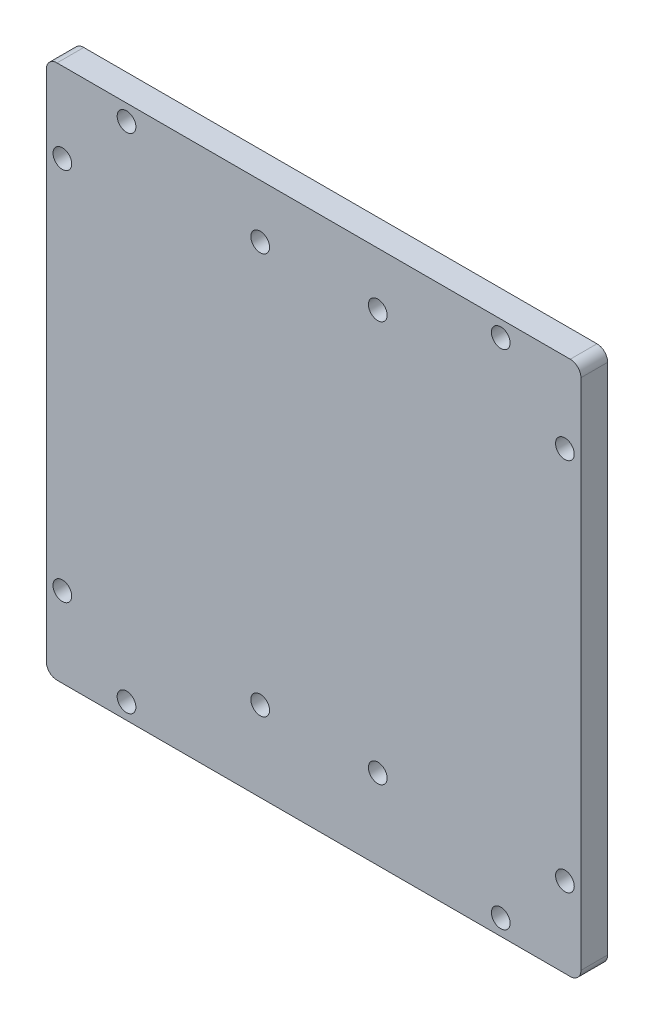
ISO-10303-21;
HEADER;
FILE_DESCRIPTION(('STEP AP214'),'2;1');
FILE_NAME('part.step','',(''),(''),'','','');
FILE_SCHEMA(('AUTOMOTIVE_DESIGN { 1 0 10303 214 1 1 1 1 }'));
ENDSEC;
DATA;
#1=APPLICATION_CONTEXT('core data for automotive mechanical design processes');
#2=APPLICATION_PROTOCOL_DEFINITION('international standard','automotive_design',2000,#1);
#3=PRODUCT_CONTEXT('',#1,'mechanical');
#4=PRODUCT('Part','Part','',(#3));
#5=PRODUCT_RELATED_PRODUCT_CATEGORY('part','',(#4));
#6=PRODUCT_DEFINITION_FORMATION('','',#4);
#7=PRODUCT_DEFINITION_CONTEXT('part definition',#1,'design');
#8=PRODUCT_DEFINITION('design','',#6,#7);
#9=PRODUCT_DEFINITION_SHAPE('','',#8);
#10=(LENGTH_UNIT() NAMED_UNIT(*) SI_UNIT(.MILLI.,.METRE.));
#11=(NAMED_UNIT(*) PLANE_ANGLE_UNIT() SI_UNIT($,.RADIAN.));
#12=(NAMED_UNIT(*) SI_UNIT($,.STERADIAN.) SOLID_ANGLE_UNIT());
#13=UNCERTAINTY_MEASURE_WITH_UNIT(LENGTH_MEASURE(1.E-05),#10,'distance_accuracy_value','');
#14=(GEOMETRIC_REPRESENTATION_CONTEXT(3) GLOBAL_UNCERTAINTY_ASSIGNED_CONTEXT((#13)) GLOBAL_UNIT_ASSIGNED_CONTEXT((#10,
#11,#12)) REPRESENTATION_CONTEXT('',''));
#15=CARTESIAN_POINT('',(0.,0.,0.));
#16=DIRECTION('',(0.,0.,1.));
#17=DIRECTION('',(1.,0.,0.));
#18=AXIS2_PLACEMENT_3D('',#15,#16,#17);
#19=CARTESIAN_POINT('',(-48.,-48.,5.));
#20=DIRECTION('',(0.,0.,1.));
#21=DIRECTION('',(1.,0.,0.));
#22=AXIS2_PLACEMENT_3D('',#19,#20,#21);
#23=PLANE('',#22);
#24=CARTESIAN_POINT('',(-9.99999999999998,-35.,5.));
#25=DIRECTION('',(0.,0.,1.));
#26=DIRECTION('',(1.,0.,0.));
#27=AXIS2_PLACEMENT_3D('',#24,#25,#26);
#28=CIRCLE('',#27,1.75);
#29=CARTESIAN_POINT('',(-8.24999999999998,-35.,5.));
#30=VERTEX_POINT('',#29);
#31=EDGE_CURVE('E236',#30,#30,#28,.T.);
#32=ORIENTED_EDGE('',*,*,#31,.F.);
#33=EDGE_LOOP('',(#32));
#34=FACE_BOUND('',#33,.T.);
#35=CARTESIAN_POINT('',(-35.,-47.,5.));
#36=DIRECTION('',(0.,0.,1.));
#37=DIRECTION('',(-1.,0.,0.));
#38=AXIS2_PLACEMENT_3D('',#35,#36,#37);
#39=CIRCLE('',#38,1.75);
#40=CARTESIAN_POINT('',(-36.75,-47.,5.));
#41=VERTEX_POINT('',#40);
#42=EDGE_CURVE('E224',#41,#41,#39,.T.);
#43=ORIENTED_EDGE('',*,*,#42,.F.);
#44=EDGE_LOOP('',(#43));
#45=FACE_BOUND('',#44,.T.);
#46=CARTESIAN_POINT('',(-35.,47.,5.));
#47=DIRECTION('',(0.,0.,1.));
#48=DIRECTION('',(1.,0.,0.));
#49=AXIS2_PLACEMENT_3D('',#46,#47,#48);
#50=CIRCLE('',#49,1.75);
#51=CARTESIAN_POINT('',(-33.25,47.,5.));
#52=VERTEX_POINT('',#51);
#53=EDGE_CURVE('E212',#52,#52,#50,.T.);
#54=ORIENTED_EDGE('',*,*,#53,.F.);
#55=EDGE_LOOP('',(#54));
#56=FACE_BOUND('',#55,.T.);
#57=CARTESIAN_POINT('',(47.,-35.,5.));
#58=DIRECTION('',(0.,0.,1.));
#59=DIRECTION('',(1.,0.,0.));
#60=AXIS2_PLACEMENT_3D('',#57,#58,#59);
#61=CIRCLE('',#60,1.75);
#62=CARTESIAN_POINT('',(48.75,-35.,5.));
#63=VERTEX_POINT('',#62);
#64=EDGE_CURVE('E200',#63,#63,#61,.T.);
#65=ORIENTED_EDGE('',*,*,#64,.F.);
#66=EDGE_LOOP('',(#65));
#67=FACE_BOUND('',#66,.T.);
#68=CARTESIAN_POINT('',(-47.,35.,5.));
#69=DIRECTION('',(0.,0.,1.));
#70=DIRECTION('',(1.,0.,0.));
#71=AXIS2_PLACEMENT_3D('',#68,#69,#70);
#72=CIRCLE('',#71,1.75);
#73=CARTESIAN_POINT('',(-45.25,35.,5.));
#74=VERTEX_POINT('',#73);
#75=EDGE_CURVE('E188',#74,#74,#72,.T.);
#76=ORIENTED_EDGE('',*,*,#75,.F.);
#77=EDGE_LOOP('',(#76));
#78=FACE_BOUND('',#77,.T.);
#79=CARTESIAN_POINT('',(-10.,40.,5.));
#80=DIRECTION('',(0.,0.,1.));
#81=DIRECTION('',(1.,0.,0.));
#82=AXIS2_PLACEMENT_3D('',#79,#80,#81);
#83=CIRCLE('',#82,1.75);
#84=CARTESIAN_POINT('',(-8.25000000000001,40.,5.));
#85=VERTEX_POINT('',#84);
#86=EDGE_CURVE('E134',#85,#85,#83,.T.);
#87=ORIENTED_EDGE('',*,*,#86,.F.);
#88=EDGE_LOOP('',(#87));
#89=FACE_BOUND('',#88,.T.);
#90=CARTESIAN_POINT('',(-48.,-48.,5.));
#91=DIRECTION('',(0.,0.,1.));
#92=DIRECTION('',(1.,0.,0.));
#93=AXIS2_PLACEMENT_3D('',#90,#91,#92);
#94=CIRCLE('',#93,2.);
#95=CARTESIAN_POINT('',(-50.,-48.,5.));
#96=VERTEX_POINT('',#95);
#97=CARTESIAN_POINT('',(-48.,-50.,5.));
#98=VERTEX_POINT('',#97);
#99=EDGE_CURVE('E145',#96,#98,#94,.T.);
#100=ORIENTED_EDGE('',*,*,#99,.T.);
#101=DIRECTION('',(1.,0.,0.));
#102=VECTOR('',#101,1.);
#103=CARTESIAN_POINT('',(-48.,-50.,5.));
#104=LINE('',#103,#102);
#105=CARTESIAN_POINT('',(48.,-50.,5.));
#106=VERTEX_POINT('',#105);
#107=EDGE_CURVE('E93',#98,#106,#104,.T.);
#108=ORIENTED_EDGE('',*,*,#107,.T.);
#109=CARTESIAN_POINT('',(48.,-48.,5.));
#110=DIRECTION('',(0.,0.,1.));
#111=DIRECTION('',(1.,0.,0.));
#112=AXIS2_PLACEMENT_3D('',#109,#110,#111);
#113=CIRCLE('',#112,2.);
#114=CARTESIAN_POINT('',(50.,-48.,5.));
#115=VERTEX_POINT('',#114);
#116=EDGE_CURVE('E160',#106,#115,#113,.T.);
#117=ORIENTED_EDGE('',*,*,#116,.T.);
#118=DIRECTION('',(0.,1.,0.));
#119=VECTOR('',#118,1.);
#120=CARTESIAN_POINT('',(50.,-48.,5.));
#121=LINE('',#120,#119);
#122=CARTESIAN_POINT('',(50.,48.,5.));
#123=VERTEX_POINT('',#122);
#124=EDGE_CURVE('E173',#115,#123,#121,.T.);
#125=ORIENTED_EDGE('',*,*,#124,.T.);
#126=CARTESIAN_POINT('',(48.,48.,5.));
#127=DIRECTION('',(0.,0.,1.));
#128=DIRECTION('',(1.,0.,0.));
#129=AXIS2_PLACEMENT_3D('',#126,#127,#128);
#130=CIRCLE('',#129,2.);
#131=CARTESIAN_POINT('',(48.,50.,5.));
#132=VERTEX_POINT('',#131);
#133=EDGE_CURVE('E112',#123,#132,#130,.T.);
#134=ORIENTED_EDGE('',*,*,#133,.T.);
#135=DIRECTION('',(-1.,0.,0.));
#136=VECTOR('',#135,1.);
#137=CARTESIAN_POINT('',(-48.,50.,5.));
#138=LINE('',#137,#136);
#139=CARTESIAN_POINT('',(-48.,50.,5.));
#140=VERTEX_POINT('',#139);
#141=EDGE_CURVE('E106',#132,#140,#138,.T.);
#142=ORIENTED_EDGE('',*,*,#141,.T.);
#143=CARTESIAN_POINT('',(-48.,48.,5.));
#144=DIRECTION('',(0.,0.,1.));
#145=DIRECTION('',(1.,0.,0.));
#146=AXIS2_PLACEMENT_3D('',#143,#144,#145);
#147=CIRCLE('',#146,2.);
#148=CARTESIAN_POINT('',(-50.,48.,5.));
#149=VERTEX_POINT('',#148);
#150=EDGE_CURVE('E110',#140,#149,#147,.T.);
#151=ORIENTED_EDGE('',*,*,#150,.T.);
#152=DIRECTION('',(0.,-1.,0.));
#153=VECTOR('',#152,1.);
#154=CARTESIAN_POINT('',(-50.,-48.,5.));
#155=LINE('',#154,#153);
#156=EDGE_CURVE('E50',#149,#96,#155,.T.);
#157=ORIENTED_EDGE('',*,*,#156,.T.);
#158=EDGE_LOOP('',(#100,#108,#117,#125,#134,#142,#151,#157));
#159=FACE_BOUND('',#158,.T.);
#160=CARTESIAN_POINT('',(12.,40.,5.));
#161=DIRECTION('',(0.,0.,1.));
#162=DIRECTION('',(1.,0.,0.));
#163=AXIS2_PLACEMENT_3D('',#160,#161,#162);
#164=CIRCLE('',#163,1.75);
#165=CARTESIAN_POINT('',(13.75,40.,5.));
#166=VERTEX_POINT('',#165);
#167=EDGE_CURVE('E182',#166,#166,#164,.T.);
#168=ORIENTED_EDGE('',*,*,#167,.F.);
#169=EDGE_LOOP('',(#168));
#170=FACE_BOUND('',#169,.T.);
#171=CARTESIAN_POINT('',(47.,35.,5.));
#172=DIRECTION('',(0.,0.,1.));
#173=DIRECTION('',(-1.,0.,0.));
#174=AXIS2_PLACEMENT_3D('',#171,#172,#173);
#175=CIRCLE('',#174,1.75);
#176=CARTESIAN_POINT('',(45.25,35.,5.));
#177=VERTEX_POINT('',#176);
#178=EDGE_CURVE('E194',#177,#177,#175,.T.);
#179=ORIENTED_EDGE('',*,*,#178,.F.);
#180=EDGE_LOOP('',(#179));
#181=FACE_BOUND('',#180,.T.);
#182=CARTESIAN_POINT('',(-47.,-35.,5.));
#183=DIRECTION('',(0.,0.,1.));
#184=DIRECTION('',(-1.,0.,0.));
#185=AXIS2_PLACEMENT_3D('',#182,#183,#184);
#186=CIRCLE('',#185,1.75);
#187=CARTESIAN_POINT('',(-48.75,-35.,5.));
#188=VERTEX_POINT('',#187);
#189=EDGE_CURVE('E206',#188,#188,#186,.T.);
#190=ORIENTED_EDGE('',*,*,#189,.F.);
#191=EDGE_LOOP('',(#190));
#192=FACE_BOUND('',#191,.T.);
#193=CARTESIAN_POINT('',(35.,47.,5.));
#194=DIRECTION('',(0.,0.,1.));
#195=DIRECTION('',(-1.,0.,0.));
#196=AXIS2_PLACEMENT_3D('',#193,#194,#195);
#197=CIRCLE('',#196,1.75);
#198=CARTESIAN_POINT('',(33.25,47.,5.));
#199=VERTEX_POINT('',#198);
#200=EDGE_CURVE('E218',#199,#199,#197,.T.);
#201=ORIENTED_EDGE('',*,*,#200,.F.);
#202=EDGE_LOOP('',(#201));
#203=FACE_BOUND('',#202,.T.);
#204=CARTESIAN_POINT('',(35.,-47.,5.));
#205=DIRECTION('',(0.,0.,1.));
#206=DIRECTION('',(1.,0.,0.));
#207=AXIS2_PLACEMENT_3D('',#204,#205,#206);
#208=CIRCLE('',#207,1.75);
#209=CARTESIAN_POINT('',(36.75,-47.,5.));
#210=VERTEX_POINT('',#209);
#211=EDGE_CURVE('E230',#210,#210,#208,.T.);
#212=ORIENTED_EDGE('',*,*,#211,.F.);
#213=EDGE_LOOP('',(#212));
#214=FACE_BOUND('',#213,.T.);
#215=CARTESIAN_POINT('',(12.,-35.,5.));
#216=DIRECTION('',(0.,0.,1.));
#217=DIRECTION('',(1.,0.,0.));
#218=AXIS2_PLACEMENT_3D('',#215,#216,#217);
#219=CIRCLE('',#218,1.75);
#220=CARTESIAN_POINT('',(13.75,-35.,5.));
#221=VERTEX_POINT('',#220);
#222=EDGE_CURVE('E242',#221,#221,#219,.T.);
#223=ORIENTED_EDGE('',*,*,#222,.F.);
#224=EDGE_LOOP('',(#223));
#225=FACE_BOUND('',#224,.T.);
#226=ADVANCED_FACE('F33',(#34,#45,#56,#67,#78,#89,#159,#170,#181,#192,#203,#214,#225),#23,.T.);
#227=CARTESIAN_POINT('',(-48.,-48.,0.));
#228=DIRECTION('',(0.,0.,1.));
#229=DIRECTION('',(1.,0.,0.));
#230=AXIS2_PLACEMENT_3D('',#227,#228,#229);
#231=PLANE('',#230);
#232=CARTESIAN_POINT('',(-48.,-48.,0.));
#233=DIRECTION('',(0.,0.,1.));
#234=DIRECTION('',(1.,0.,0.));
#235=AXIS2_PLACEMENT_3D('',#232,#233,#234);
#236=CIRCLE('',#235,2.);
#237=CARTESIAN_POINT('',(-50.,-48.,0.));
#238=VERTEX_POINT('',#237);
#239=CARTESIAN_POINT('',(-48.,-50.,0.));
#240=VERTEX_POINT('',#239);
#241=EDGE_CURVE('E130',#238,#240,#236,.T.);
#242=ORIENTED_EDGE('',*,*,#241,.F.);
#243=DIRECTION('',(0.,-1.,0.));
#244=VECTOR('',#243,1.);
#245=CARTESIAN_POINT('',(-50.,-48.,0.));
#246=LINE('',#245,#244);
#247=CARTESIAN_POINT('',(-50.,48.,0.));
#248=VERTEX_POINT('',#247);
#249=EDGE_CURVE('E85',#248,#238,#246,.T.);
#250=ORIENTED_EDGE('',*,*,#249,.F.);
#251=CARTESIAN_POINT('',(-48.,48.,0.));
#252=DIRECTION('',(0.,0.,1.));
#253=DIRECTION('',(1.,0.,0.));
#254=AXIS2_PLACEMENT_3D('',#251,#252,#253);
#255=CIRCLE('',#254,2.);
#256=CARTESIAN_POINT('',(-48.,50.,0.));
#257=VERTEX_POINT('',#256);
#258=EDGE_CURVE('E79',#257,#248,#255,.T.);
#259=ORIENTED_EDGE('',*,*,#258,.F.);
#260=DIRECTION('',(-1.,0.,0.));
#261=VECTOR('',#260,1.);
#262=CARTESIAN_POINT('',(-48.,50.,0.));
#263=LINE('',#262,#261);
#264=CARTESIAN_POINT('',(48.,50.,0.));
#265=VERTEX_POINT('',#264);
#266=EDGE_CURVE('E120',#265,#257,#263,.T.);
#267=ORIENTED_EDGE('',*,*,#266,.F.);
#268=CARTESIAN_POINT('',(48.,48.,0.));
#269=DIRECTION('',(0.,0.,1.));
#270=DIRECTION('',(1.,0.,0.));
#271=AXIS2_PLACEMENT_3D('',#268,#269,#270);
#272=CIRCLE('',#271,2.);
#273=CARTESIAN_POINT('',(50.,48.,0.));
#274=VERTEX_POINT('',#273);
#275=EDGE_CURVE('E140',#274,#265,#272,.T.);
#276=ORIENTED_EDGE('',*,*,#275,.F.);
#277=DIRECTION('',(0.,1.,0.));
#278=VECTOR('',#277,1.);
#279=CARTESIAN_POINT('',(50.,-48.,0.));
#280=LINE('',#279,#278);
#281=CARTESIAN_POINT('',(50.,-48.,0.));
#282=VERTEX_POINT('',#281);
#283=EDGE_CURVE('E138',#282,#274,#280,.T.);
#284=ORIENTED_EDGE('',*,*,#283,.F.);
#285=CARTESIAN_POINT('',(48.,-48.,0.));
#286=DIRECTION('',(0.,0.,1.));
#287=DIRECTION('',(1.,0.,0.));
#288=AXIS2_PLACEMENT_3D('',#285,#286,#287);
#289=CIRCLE('',#288,2.);
#290=CARTESIAN_POINT('',(48.,-50.,0.));
#291=VERTEX_POINT('',#290);
#292=EDGE_CURVE('E136',#291,#282,#289,.T.);
#293=ORIENTED_EDGE('',*,*,#292,.F.);
#294=DIRECTION('',(1.,0.,0.));
#295=VECTOR('',#294,1.);
#296=CARTESIAN_POINT('',(-48.,-50.,0.));
#297=LINE('',#296,#295);
#298=EDGE_CURVE('E133',#240,#291,#297,.T.);
#299=ORIENTED_EDGE('',*,*,#298,.F.);
#300=EDGE_LOOP('',(#242,#250,#259,#267,#276,#284,#293,#299));
#301=FACE_BOUND('',#300,.T.);
#302=CARTESIAN_POINT('',(-10.,40.,0.));
#303=DIRECTION('',(0.,0.,1.));
#304=DIRECTION('',(1.,0.,0.));
#305=AXIS2_PLACEMENT_3D('',#302,#303,#304);
#306=CIRCLE('',#305,1.75);
#307=CARTESIAN_POINT('',(-8.25000000000001,40.,0.));
#308=VERTEX_POINT('',#307);
#309=EDGE_CURVE('E179',#308,#308,#306,.T.);
#310=ORIENTED_EDGE('',*,*,#309,.T.);
#311=EDGE_LOOP('',(#310));
#312=FACE_BOUND('',#311,.T.);
#313=CARTESIAN_POINT('',(12.,40.,0.));
#314=DIRECTION('',(0.,0.,1.));
#315=DIRECTION('',(1.,0.,0.));
#316=AXIS2_PLACEMENT_3D('',#313,#314,#315);
#317=CIRCLE('',#316,1.75);
#318=CARTESIAN_POINT('',(13.75,40.,0.));
#319=VERTEX_POINT('',#318);
#320=EDGE_CURVE('E185',#319,#319,#317,.T.);
#321=ORIENTED_EDGE('',*,*,#320,.T.);
#322=EDGE_LOOP('',(#321));
#323=FACE_BOUND('',#322,.T.);
#324=CARTESIAN_POINT('',(-47.,35.,0.));
#325=DIRECTION('',(0.,0.,1.));
#326=DIRECTION('',(1.,0.,0.));
#327=AXIS2_PLACEMENT_3D('',#324,#325,#326);
#328=CIRCLE('',#327,1.75);
#329=CARTESIAN_POINT('',(-45.25,35.,0.));
#330=VERTEX_POINT('',#329);
#331=EDGE_CURVE('E191',#330,#330,#328,.T.);
#332=ORIENTED_EDGE('',*,*,#331,.T.);
#333=EDGE_LOOP('',(#332));
#334=FACE_BOUND('',#333,.T.);
#335=CARTESIAN_POINT('',(47.,35.,0.));
#336=DIRECTION('',(0.,0.,1.));
#337=DIRECTION('',(-1.,0.,0.));
#338=AXIS2_PLACEMENT_3D('',#335,#336,#337);
#339=CIRCLE('',#338,1.75);
#340=CARTESIAN_POINT('',(45.25,35.,0.));
#341=VERTEX_POINT('',#340);
#342=EDGE_CURVE('E197',#341,#341,#339,.T.);
#343=ORIENTED_EDGE('',*,*,#342,.T.);
#344=EDGE_LOOP('',(#343));
#345=FACE_BOUND('',#344,.T.);
#346=CARTESIAN_POINT('',(47.,-35.,0.));
#347=DIRECTION('',(0.,0.,1.));
#348=DIRECTION('',(1.,0.,0.));
#349=AXIS2_PLACEMENT_3D('',#346,#347,#348);
#350=CIRCLE('',#349,1.75);
#351=CARTESIAN_POINT('',(48.75,-35.,0.));
#352=VERTEX_POINT('',#351);
#353=EDGE_CURVE('E203',#352,#352,#350,.T.);
#354=ORIENTED_EDGE('',*,*,#353,.T.);
#355=EDGE_LOOP('',(#354));
#356=FACE_BOUND('',#355,.T.);
#357=CARTESIAN_POINT('',(-47.,-35.,0.));
#358=DIRECTION('',(0.,0.,1.));
#359=DIRECTION('',(-1.,0.,0.));
#360=AXIS2_PLACEMENT_3D('',#357,#358,#359);
#361=CIRCLE('',#360,1.75);
#362=CARTESIAN_POINT('',(-48.75,-35.,0.));
#363=VERTEX_POINT('',#362);
#364=EDGE_CURVE('E209',#363,#363,#361,.T.);
#365=ORIENTED_EDGE('',*,*,#364,.T.);
#366=EDGE_LOOP('',(#365));
#367=FACE_BOUND('',#366,.T.);
#368=CARTESIAN_POINT('',(-35.,47.,0.));
#369=DIRECTION('',(0.,0.,1.));
#370=DIRECTION('',(1.,0.,0.));
#371=AXIS2_PLACEMENT_3D('',#368,#369,#370);
#372=CIRCLE('',#371,1.75);
#373=CARTESIAN_POINT('',(-33.25,47.,0.));
#374=VERTEX_POINT('',#373);
#375=EDGE_CURVE('E215',#374,#374,#372,.T.);
#376=ORIENTED_EDGE('',*,*,#375,.T.);
#377=EDGE_LOOP('',(#376));
#378=FACE_BOUND('',#377,.T.);
#379=CARTESIAN_POINT('',(35.,47.,0.));
#380=DIRECTION('',(0.,0.,1.));
#381=DIRECTION('',(-1.,0.,0.));
#382=AXIS2_PLACEMENT_3D('',#379,#380,#381);
#383=CIRCLE('',#382,1.75);
#384=CARTESIAN_POINT('',(33.25,47.,0.));
#385=VERTEX_POINT('',#384);
#386=EDGE_CURVE('E221',#385,#385,#383,.T.);
#387=ORIENTED_EDGE('',*,*,#386,.T.);
#388=EDGE_LOOP('',(#387));
#389=FACE_BOUND('',#388,.T.);
#390=CARTESIAN_POINT('',(-35.,-47.,0.));
#391=DIRECTION('',(0.,0.,1.));
#392=DIRECTION('',(-1.,0.,0.));
#393=AXIS2_PLACEMENT_3D('',#390,#391,#392);
#394=CIRCLE('',#393,1.75);
#395=CARTESIAN_POINT('',(-36.75,-47.,0.));
#396=VERTEX_POINT('',#395);
#397=EDGE_CURVE('E227',#396,#396,#394,.T.);
#398=ORIENTED_EDGE('',*,*,#397,.T.);
#399=EDGE_LOOP('',(#398));
#400=FACE_BOUND('',#399,.T.);
#401=CARTESIAN_POINT('',(35.,-47.,0.));
#402=DIRECTION('',(0.,0.,1.));
#403=DIRECTION('',(1.,0.,0.));
#404=AXIS2_PLACEMENT_3D('',#401,#402,#403);
#405=CIRCLE('',#404,1.75);
#406=CARTESIAN_POINT('',(36.75,-47.,0.));
#407=VERTEX_POINT('',#406);
#408=EDGE_CURVE('E233',#407,#407,#405,.T.);
#409=ORIENTED_EDGE('',*,*,#408,.T.);
#410=EDGE_LOOP('',(#409));
#411=FACE_BOUND('',#410,.T.);
#412=CARTESIAN_POINT('',(-9.99999999999998,-35.,0.));
#413=DIRECTION('',(0.,0.,1.));
#414=DIRECTION('',(1.,0.,0.));
#415=AXIS2_PLACEMENT_3D('',#412,#413,#414);
#416=CIRCLE('',#415,1.75);
#417=CARTESIAN_POINT('',(-8.24999999999998,-35.,0.));
#418=VERTEX_POINT('',#417);
#419=EDGE_CURVE('E239',#418,#418,#416,.T.);
#420=ORIENTED_EDGE('',*,*,#419,.T.);
#421=EDGE_LOOP('',(#420));
#422=FACE_BOUND('',#421,.T.);
#423=CARTESIAN_POINT('',(12.,-35.,0.));
#424=DIRECTION('',(0.,0.,1.));
#425=DIRECTION('',(1.,0.,0.));
#426=AXIS2_PLACEMENT_3D('',#423,#424,#425);
#427=CIRCLE('',#426,1.75);
#428=CARTESIAN_POINT('',(13.75,-35.,0.));
#429=VERTEX_POINT('',#428);
#430=EDGE_CURVE('E245',#429,#429,#427,.T.);
#431=ORIENTED_EDGE('',*,*,#430,.T.);
#432=EDGE_LOOP('',(#431));
#433=FACE_BOUND('',#432,.T.);
#434=ADVANCED_FACE('F164',(#301,#312,#323,#334,#345,#356,#367,#378,#389,#400,#411,#422,#433),
#231,.F.);
#435=CARTESIAN_POINT('',(-48.,-48.,5.));
#436=DIRECTION('',(0.,0.,-1.));
#437=DIRECTION('',(-1.,0.,0.));
#438=AXIS2_PLACEMENT_3D('',#435,#436,#437);
#439=CYLINDRICAL_SURFACE('',#438,2.);
#440=ORIENTED_EDGE('',*,*,#241,.T.);
#441=DIRECTION('',(0.,0.,-1.));
#442=VECTOR('',#441,1.);
#443=CARTESIAN_POINT('',(-48.,-50.,5.));
#444=LINE('',#443,#442);
#445=EDGE_CURVE('E11',#98,#240,#444,.T.);
#446=ORIENTED_EDGE('',*,*,#445,.F.);
#447=ORIENTED_EDGE('',*,*,#99,.F.);
#448=DIRECTION('',(0.,0.,-1.));
#449=VECTOR('',#448,1.);
#450=CARTESIAN_POINT('',(-50.,-48.,5.));
#451=LINE('',#450,#449);
#452=EDGE_CURVE('E126',#96,#238,#451,.T.);
#453=ORIENTED_EDGE('',*,*,#452,.T.);
#454=EDGE_LOOP('',(#440,#446,#447,#453));
#455=FACE_BOUND('',#454,.T.);
#456=ADVANCED_FACE('F35',(#455),#439,.T.);
#457=CARTESIAN_POINT('',(-48.,-50.,5.));
#458=DIRECTION('',(0.,1.,0.));
#459=DIRECTION('',(0.,0.,1.));
#460=AXIS2_PLACEMENT_3D('',#457,#458,#459);
#461=PLANE('',#460);
#462=ORIENTED_EDGE('',*,*,#298,.T.);
#463=DIRECTION('',(0.,0.,-1.));
#464=VECTOR('',#463,1.);
#465=CARTESIAN_POINT('',(48.,-50.,5.));
#466=LINE('',#465,#464);
#467=EDGE_CURVE('E42',#106,#291,#466,.T.);
#468=ORIENTED_EDGE('',*,*,#467,.F.);
#469=ORIENTED_EDGE('',*,*,#107,.F.);
#470=ORIENTED_EDGE('',*,*,#445,.T.);
#471=EDGE_LOOP('',(#462,#468,#469,#470));
#472=FACE_BOUND('',#471,.T.);
#473=ADVANCED_FACE('F279',(#472),#461,.F.);
#474=CARTESIAN_POINT('',(48.,-48.,5.));
#475=DIRECTION('',(0.,0.,-1.));
#476=DIRECTION('',(-1.,0.,0.));
#477=AXIS2_PLACEMENT_3D('',#474,#475,#476);
#478=CYLINDRICAL_SURFACE('',#477,2.);
#479=ORIENTED_EDGE('',*,*,#292,.T.);
#480=DIRECTION('',(0.,0.,-1.));
#481=VECTOR('',#480,1.);
#482=CARTESIAN_POINT('',(50.,-48.,5.));
#483=LINE('',#482,#481);
#484=EDGE_CURVE('E152',#115,#282,#483,.T.);
#485=ORIENTED_EDGE('',*,*,#484,.F.);
#486=ORIENTED_EDGE('',*,*,#116,.F.);
#487=ORIENTED_EDGE('',*,*,#467,.T.);
#488=EDGE_LOOP('',(#479,#485,#486,#487));
#489=FACE_BOUND('',#488,.T.);
#490=ADVANCED_FACE('F158',(#489),#478,.T.);
#491=CARTESIAN_POINT('',(50.,-48.,5.));
#492=DIRECTION('',(-1.,0.,0.));
#493=DIRECTION('',(0.,0.,1.));
#494=AXIS2_PLACEMENT_3D('',#491,#492,#493);
#495=PLANE('',#494);
#496=ORIENTED_EDGE('',*,*,#283,.T.);
#497=DIRECTION('',(0.,0.,-1.));
#498=VECTOR('',#497,1.);
#499=CARTESIAN_POINT('',(50.,48.,5.));
#500=LINE('',#499,#498);
#501=EDGE_CURVE('E149',#123,#274,#500,.T.);
#502=ORIENTED_EDGE('',*,*,#501,.F.);
#503=ORIENTED_EDGE('',*,*,#124,.F.);
#504=ORIENTED_EDGE('',*,*,#484,.T.);
#505=EDGE_LOOP('',(#496,#502,#503,#504));
#506=FACE_BOUND('',#505,.T.);
#507=ADVANCED_FACE('F169',(#506),#495,.F.);
#508=CARTESIAN_POINT('',(48.,48.,5.));
#509=DIRECTION('',(0.,0.,-1.));
#510=DIRECTION('',(-1.,0.,0.));
#511=AXIS2_PLACEMENT_3D('',#508,#509,#510);
#512=CYLINDRICAL_SURFACE('',#511,2.);
#513=ORIENTED_EDGE('',*,*,#275,.T.);
#514=DIRECTION('',(0.,0.,-1.));
#515=VECTOR('',#514,1.);
#516=CARTESIAN_POINT('',(48.,50.,5.));
#517=LINE('',#516,#515);
#518=EDGE_CURVE('E121',#132,#265,#517,.T.);
#519=ORIENTED_EDGE('',*,*,#518,.F.);
#520=ORIENTED_EDGE('',*,*,#133,.F.);
#521=ORIENTED_EDGE('',*,*,#501,.T.);
#522=EDGE_LOOP('',(#513,#519,#520,#521));
#523=FACE_BOUND('',#522,.T.);
#524=ADVANCED_FACE('F172',(#523),#512,.T.);
#525=CARTESIAN_POINT('',(-48.,50.,5.));
#526=DIRECTION('',(0.,-1.,0.));
#527=DIRECTION('',(0.,0.,-1.));
#528=AXIS2_PLACEMENT_3D('',#525,#526,#527);
#529=PLANE('',#528);
#530=ORIENTED_EDGE('',*,*,#266,.T.);
#531=DIRECTION('',(0.,0.,-1.));
#532=VECTOR('',#531,1.);
#533=CARTESIAN_POINT('',(-48.,50.,5.));
#534=LINE('',#533,#532);
#535=EDGE_CURVE('E117',#140,#257,#534,.T.);
#536=ORIENTED_EDGE('',*,*,#535,.F.);
#537=ORIENTED_EDGE('',*,*,#141,.F.);
#538=ORIENTED_EDGE('',*,*,#518,.T.);
#539=EDGE_LOOP('',(#530,#536,#537,#538));
#540=FACE_BOUND('',#539,.T.);
#541=ADVANCED_FACE('F118',(#540),#529,.F.);
#542=CARTESIAN_POINT('',(-48.,48.,5.));
#543=DIRECTION('',(0.,0.,-1.));
#544=DIRECTION('',(-1.,0.,0.));
#545=AXIS2_PLACEMENT_3D('',#542,#543,#544);
#546=CYLINDRICAL_SURFACE('',#545,2.);
#547=ORIENTED_EDGE('',*,*,#258,.T.);
#548=DIRECTION('',(0.,0.,-1.));
#549=VECTOR('',#548,1.);
#550=CARTESIAN_POINT('',(-50.,48.,5.));
#551=LINE('',#550,#549);
#552=EDGE_CURVE('E122',#149,#248,#551,.T.);
#553=ORIENTED_EDGE('',*,*,#552,.F.);
#554=ORIENTED_EDGE('',*,*,#150,.F.);
#555=ORIENTED_EDGE('',*,*,#535,.T.);
#556=EDGE_LOOP('',(#547,#553,#554,#555));
#557=FACE_BOUND('',#556,.T.);
#558=ADVANCED_FACE('F124',(#557),#546,.T.);
#559=CARTESIAN_POINT('',(-50.,-48.,5.));
#560=DIRECTION('',(1.,0.,0.));
#561=DIRECTION('',(0.,0.,-1.));
#562=AXIS2_PLACEMENT_3D('',#559,#560,#561);
#563=PLANE('',#562);
#564=ORIENTED_EDGE('',*,*,#249,.T.);
#565=ORIENTED_EDGE('',*,*,#452,.F.);
#566=ORIENTED_EDGE('',*,*,#156,.F.);
#567=ORIENTED_EDGE('',*,*,#552,.T.);
#568=EDGE_LOOP('',(#564,#565,#566,#567));
#569=FACE_BOUND('',#568,.T.);
#570=ADVANCED_FACE('F267',(#569),#563,.F.);
#571=CARTESIAN_POINT('',(-10.,40.,5.));
#572=DIRECTION('',(0.,0.,-1.));
#573=DIRECTION('',(-1.,0.,0.));
#574=AXIS2_PLACEMENT_3D('',#571,#572,#573);
#575=CYLINDRICAL_SURFACE('',#574,1.75);
#576=ORIENTED_EDGE('',*,*,#86,.T.);
#577=EDGE_LOOP('',(#576));
#578=FACE_BOUND('',#577,.T.);
#579=ORIENTED_EDGE('',*,*,#309,.F.);
#580=EDGE_LOOP('',(#579));
#581=FACE_BOUND('',#580,.T.);
#582=ADVANCED_FACE('F264',(#578,#581),#575,.F.);
#583=CARTESIAN_POINT('',(12.,40.,5.));
#584=DIRECTION('',(0.,0.,-1.));
#585=DIRECTION('',(-1.,0.,0.));
#586=AXIS2_PLACEMENT_3D('',#583,#584,#585);
#587=CYLINDRICAL_SURFACE('',#586,1.75);
#588=ORIENTED_EDGE('',*,*,#167,.T.);
#589=EDGE_LOOP('',(#588));
#590=FACE_BOUND('',#589,.T.);
#591=ORIENTED_EDGE('',*,*,#320,.F.);
#592=EDGE_LOOP('',(#591));
#593=FACE_BOUND('',#592,.T.);
#594=ADVANCED_FACE('F343',(#590,#593),#587,.F.);
#595=CARTESIAN_POINT('',(-47.,35.,5.));
#596=DIRECTION('',(0.,0.,-1.));
#597=DIRECTION('',(-1.,0.,0.));
#598=AXIS2_PLACEMENT_3D('',#595,#596,#597);
#599=CYLINDRICAL_SURFACE('',#598,1.75);
#600=ORIENTED_EDGE('',*,*,#75,.T.);
#601=EDGE_LOOP('',(#600));
#602=FACE_BOUND('',#601,.T.);
#603=ORIENTED_EDGE('',*,*,#331,.F.);
#604=EDGE_LOOP('',(#603));
#605=FACE_BOUND('',#604,.T.);
#606=ADVANCED_FACE('F351',(#602,#605),#599,.F.);
#607=CARTESIAN_POINT('',(47.,35.,5.));
#608=DIRECTION('',(0.,0.,-1.));
#609=DIRECTION('',(-1.,0.,0.));
#610=AXIS2_PLACEMENT_3D('',#607,#608,#609);
#611=CYLINDRICAL_SURFACE('',#610,1.75);
#612=ORIENTED_EDGE('',*,*,#178,.T.);
#613=EDGE_LOOP('',(#612));
#614=FACE_BOUND('',#613,.T.);
#615=ORIENTED_EDGE('',*,*,#342,.F.);
#616=EDGE_LOOP('',(#615));
#617=FACE_BOUND('',#616,.T.);
#618=ADVANCED_FACE('F359',(#614,#617),#611,.F.);
#619=CARTESIAN_POINT('',(47.,-35.,5.));
#620=DIRECTION('',(0.,0.,-1.));
#621=DIRECTION('',(-1.,0.,0.));
#622=AXIS2_PLACEMENT_3D('',#619,#620,#621);
#623=CYLINDRICAL_SURFACE('',#622,1.75);
#624=ORIENTED_EDGE('',*,*,#64,.T.);
#625=EDGE_LOOP('',(#624));
#626=FACE_BOUND('',#625,.T.);
#627=ORIENTED_EDGE('',*,*,#353,.F.);
#628=EDGE_LOOP('',(#627));
#629=FACE_BOUND('',#628,.T.);
#630=ADVANCED_FACE('F368',(#626,#629),#623,.F.);
#631=CARTESIAN_POINT('',(-47.,-35.,5.));
#632=DIRECTION('',(0.,0.,-1.));
#633=DIRECTION('',(-1.,0.,0.));
#634=AXIS2_PLACEMENT_3D('',#631,#632,#633);
#635=CYLINDRICAL_SURFACE('',#634,1.75);
#636=ORIENTED_EDGE('',*,*,#189,.T.);
#637=EDGE_LOOP('',(#636));
#638=FACE_BOUND('',#637,.T.);
#639=ORIENTED_EDGE('',*,*,#364,.F.);
#640=EDGE_LOOP('',(#639));
#641=FACE_BOUND('',#640,.T.);
#642=ADVANCED_FACE('F377',(#638,#641),#635,.F.);
#643=CARTESIAN_POINT('',(-35.,47.,5.));
#644=DIRECTION('',(0.,0.,-1.));
#645=DIRECTION('',(-1.,0.,0.));
#646=AXIS2_PLACEMENT_3D('',#643,#644,#645);
#647=CYLINDRICAL_SURFACE('',#646,1.75);
#648=ORIENTED_EDGE('',*,*,#53,.T.);
#649=EDGE_LOOP('',(#648));
#650=FACE_BOUND('',#649,.T.);
#651=ORIENTED_EDGE('',*,*,#375,.F.);
#652=EDGE_LOOP('',(#651));
#653=FACE_BOUND('',#652,.T.);
#654=ADVANCED_FACE('F386',(#650,#653),#647,.F.);
#655=CARTESIAN_POINT('',(35.,47.,5.));
#656=DIRECTION('',(0.,0.,-1.));
#657=DIRECTION('',(-1.,0.,0.));
#658=AXIS2_PLACEMENT_3D('',#655,#656,#657);
#659=CYLINDRICAL_SURFACE('',#658,1.75);
#660=ORIENTED_EDGE('',*,*,#200,.T.);
#661=EDGE_LOOP('',(#660));
#662=FACE_BOUND('',#661,.T.);
#663=ORIENTED_EDGE('',*,*,#386,.F.);
#664=EDGE_LOOP('',(#663));
#665=FACE_BOUND('',#664,.T.);
#666=ADVANCED_FACE('F395',(#662,#665),#659,.F.);
#667=CARTESIAN_POINT('',(-35.,-47.,5.));
#668=DIRECTION('',(0.,0.,-1.));
#669=DIRECTION('',(-1.,0.,0.));
#670=AXIS2_PLACEMENT_3D('',#667,#668,#669);
#671=CYLINDRICAL_SURFACE('',#670,1.75);
#672=ORIENTED_EDGE('',*,*,#42,.T.);
#673=EDGE_LOOP('',(#672));
#674=FACE_BOUND('',#673,.T.);
#675=ORIENTED_EDGE('',*,*,#397,.F.);
#676=EDGE_LOOP('',(#675));
#677=FACE_BOUND('',#676,.T.);
#678=ADVANCED_FACE('F404',(#674,#677),#671,.F.);
#679=CARTESIAN_POINT('',(35.,-47.,5.));
#680=DIRECTION('',(0.,0.,-1.));
#681=DIRECTION('',(-1.,0.,0.));
#682=AXIS2_PLACEMENT_3D('',#679,#680,#681);
#683=CYLINDRICAL_SURFACE('',#682,1.75);
#684=ORIENTED_EDGE('',*,*,#211,.T.);
#685=EDGE_LOOP('',(#684));
#686=FACE_BOUND('',#685,.T.);
#687=ORIENTED_EDGE('',*,*,#408,.F.);
#688=EDGE_LOOP('',(#687));
#689=FACE_BOUND('',#688,.T.);
#690=ADVANCED_FACE('F413',(#686,#689),#683,.F.);
#691=CARTESIAN_POINT('',(-9.99999999999998,-35.,5.));
#692=DIRECTION('',(0.,0.,-1.));
#693=DIRECTION('',(-1.,0.,0.));
#694=AXIS2_PLACEMENT_3D('',#691,#692,#693);
#695=CYLINDRICAL_SURFACE('',#694,1.75);
#696=ORIENTED_EDGE('',*,*,#31,.T.);
#697=EDGE_LOOP('',(#696));
#698=FACE_BOUND('',#697,.T.);
#699=ORIENTED_EDGE('',*,*,#419,.F.);
#700=EDGE_LOOP('',(#699));
#701=FACE_BOUND('',#700,.T.);
#702=ADVANCED_FACE('F422',(#698,#701),#695,.F.);
#703=CARTESIAN_POINT('',(12.,-35.,5.));
#704=DIRECTION('',(0.,0.,-1.));
#705=DIRECTION('',(-1.,0.,0.));
#706=AXIS2_PLACEMENT_3D('',#703,#704,#705);
#707=CYLINDRICAL_SURFACE('',#706,1.75);
#708=ORIENTED_EDGE('',*,*,#222,.T.);
#709=EDGE_LOOP('',(#708));
#710=FACE_BOUND('',#709,.T.);
#711=ORIENTED_EDGE('',*,*,#430,.F.);
#712=EDGE_LOOP('',(#711));
#713=FACE_BOUND('',#712,.T.);
#714=ADVANCED_FACE('F251',(#710,#713),#707,.F.);
#715=CLOSED_SHELL('',(#226,#434,#456,#473,#490,#507,#524,#541,#558,#570,#582,#594,#606,#618,
#630,#642,#654,#666,#678,#690,#702,#714));
#716=MANIFOLD_SOLID_BREP('B2',#715);
#717=ADVANCED_BREP_SHAPE_REPRESENTATION('',(#18,#716),#14);
#718=SHAPE_DEFINITION_REPRESENTATION(#9,#717);
ENDSEC;
END-ISO-10303-21;
